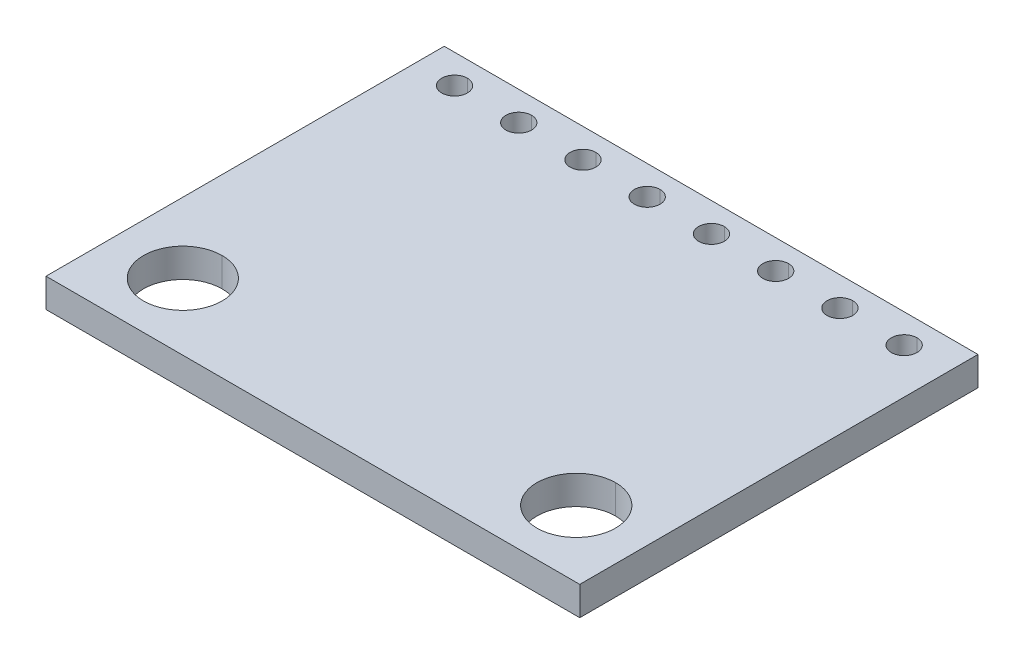
ISO-10303-21;
HEADER;
FILE_DESCRIPTION(('STEP AP214'),'2;1');
FILE_NAME('part.step','',(''),(''),'','','');
FILE_SCHEMA(('AUTOMOTIVE_DESIGN { 1 0 10303 214 1 1 1 1 }'));
ENDSEC;
DATA;
#1=APPLICATION_CONTEXT('core data for automotive mechanical design processes');
#2=APPLICATION_PROTOCOL_DEFINITION('international standard','automotive_design',2000,#1);
#3=PRODUCT_CONTEXT('',#1,'mechanical');
#4=PRODUCT('Part','Part','',(#3));
#5=PRODUCT_RELATED_PRODUCT_CATEGORY('part','',(#4));
#6=PRODUCT_DEFINITION_FORMATION('','',#4);
#7=PRODUCT_DEFINITION_CONTEXT('part definition',#1,'design');
#8=PRODUCT_DEFINITION('design','',#6,#7);
#9=PRODUCT_DEFINITION_SHAPE('','',#8);
#10=(LENGTH_UNIT() NAMED_UNIT(*) SI_UNIT(.MILLI.,.METRE.));
#11=(NAMED_UNIT(*) PLANE_ANGLE_UNIT() SI_UNIT($,.RADIAN.));
#12=(NAMED_UNIT(*) SI_UNIT($,.STERADIAN.) SOLID_ANGLE_UNIT());
#13=UNCERTAINTY_MEASURE_WITH_UNIT(LENGTH_MEASURE(1.E-05),#10,'distance_accuracy_value','');
#14=(GEOMETRIC_REPRESENTATION_CONTEXT(3) GLOBAL_UNCERTAINTY_ASSIGNED_CONTEXT((#13)) GLOBAL_UNIT_ASSIGNED_CONTEXT((#10,
#11,#12)) REPRESENTATION_CONTEXT('',''));
#15=CARTESIAN_POINT('',(0.,0.,0.));
#16=DIRECTION('',(0.,0.,1.));
#17=DIRECTION('',(1.,0.,0.));
#18=AXIS2_PLACEMENT_3D('',#15,#16,#17);
#19=CARTESIAN_POINT('',(8.7757,0.5715,-6.731));
#20=DIRECTION('',(0.,-1.,0.));
#21=DIRECTION('',(0.,0.,-1.));
#22=AXIS2_PLACEMENT_3D('',#19,#20,#21);
#23=CYLINDRICAL_SURFACE('',#22,0.508);
#24=DIRECTION('',(0.,-1.,0.));
#25=VECTOR('',#24,1.);
#26=CARTESIAN_POINT('',(8.7757,0.5715,-6.223));
#27=LINE('',#26,#25);
#28=CARTESIAN_POINT('',(8.7757,0.5715,-6.223));
#29=VERTEX_POINT('',#28);
#30=CARTESIAN_POINT('',(8.7757,-0.5715,-6.223));
#31=VERTEX_POINT('',#30);
#32=EDGE_CURVE('E352',#29,#31,#27,.T.);
#33=ORIENTED_EDGE('',*,*,#32,.F.);
#34=CARTESIAN_POINT('',(8.7757,0.5715,-6.731));
#35=DIRECTION('',(0.,1.,0.));
#36=DIRECTION('',(0.,0.,1.));
#37=AXIS2_PLACEMENT_3D('',#34,#35,#36);
#38=CIRCLE('',#37,0.508);
#39=CARTESIAN_POINT('',(8.7757,0.5715,-7.239));
#40=VERTEX_POINT('',#39);
#41=EDGE_CURVE('E236',#29,#40,#38,.T.);
#42=ORIENTED_EDGE('',*,*,#41,.T.);
#43=DIRECTION('',(0.,-1.,0.));
#44=VECTOR('',#43,1.);
#45=CARTESIAN_POINT('',(8.7757,0.5715,-7.239));
#46=LINE('',#45,#44);
#47=CARTESIAN_POINT('',(8.7757,-0.5715,-7.239));
#48=VERTEX_POINT('',#47);
#49=EDGE_CURVE('E448',#40,#48,#46,.T.);
#50=ORIENTED_EDGE('',*,*,#49,.T.);
#51=CARTESIAN_POINT('',(8.7757,-0.5715,-6.731));
#52=DIRECTION('',(0.,1.,0.));
#53=DIRECTION('',(0.,0.,1.));
#54=AXIS2_PLACEMENT_3D('',#51,#52,#53);
#55=CIRCLE('',#54,0.508);
#56=EDGE_CURVE('E318',#31,#48,#55,.T.);
#57=ORIENTED_EDGE('',*,*,#56,.F.);
#58=EDGE_LOOP('',(#33,#42,#50,#57));
#59=FACE_BOUND('',#58,.T.);
#60=ADVANCED_FACE('F18',(#59),#23,.F.);
#61=CARTESIAN_POINT('',(6.2357,0.5715,-6.731));
#62=DIRECTION('',(0.,-1.,0.));
#63=DIRECTION('',(0.,0.,-1.));
#64=AXIS2_PLACEMENT_3D('',#61,#62,#63);
#65=CYLINDRICAL_SURFACE('',#64,0.508);
#66=DIRECTION('',(0.,-1.,0.));
#67=VECTOR('',#66,1.);
#68=CARTESIAN_POINT('',(6.2357,0.5715,-6.223));
#69=LINE('',#68,#67);
#70=CARTESIAN_POINT('',(6.2357,0.5715,-6.223));
#71=VERTEX_POINT('',#70);
#72=CARTESIAN_POINT('',(6.2357,-0.5715,-6.223));
#73=VERTEX_POINT('',#72);
#74=EDGE_CURVE('E363',#71,#73,#69,.T.);
#75=ORIENTED_EDGE('',*,*,#74,.F.);
#76=CARTESIAN_POINT('',(6.2357,0.5715,-6.731));
#77=DIRECTION('',(0.,1.,0.));
#78=DIRECTION('',(0.,0.,1.));
#79=AXIS2_PLACEMENT_3D('',#76,#77,#78);
#80=CIRCLE('',#79,0.508);
#81=CARTESIAN_POINT('',(6.2357,0.5715,-7.239));
#82=VERTEX_POINT('',#81);
#83=EDGE_CURVE('E276',#71,#82,#80,.T.);
#84=ORIENTED_EDGE('',*,*,#83,.T.);
#85=DIRECTION('',(0.,-1.,0.));
#86=VECTOR('',#85,1.);
#87=CARTESIAN_POINT('',(6.2357,0.5715,-7.239));
#88=LINE('',#87,#86);
#89=CARTESIAN_POINT('',(6.2357,-0.5715,-7.239));
#90=VERTEX_POINT('',#89);
#91=EDGE_CURVE('E250',#82,#90,#88,.T.);
#92=ORIENTED_EDGE('',*,*,#91,.T.);
#93=CARTESIAN_POINT('',(6.2357,-0.5715,-6.731));
#94=DIRECTION('',(0.,1.,0.));
#95=DIRECTION('',(0.,0.,1.));
#96=AXIS2_PLACEMENT_3D('',#93,#94,#95);
#97=CIRCLE('',#96,0.508);
#98=EDGE_CURVE('E325',#73,#90,#97,.T.);
#99=ORIENTED_EDGE('',*,*,#98,.F.);
#100=EDGE_LOOP('',(#75,#84,#92,#99));
#101=FACE_BOUND('',#100,.T.);
#102=ADVANCED_FACE('F605',(#101),#65,.F.);
#103=CARTESIAN_POINT('',(3.6957,0.5715,-6.731));
#104=DIRECTION('',(0.,-1.,0.));
#105=DIRECTION('',(0.,0.,-1.));
#106=AXIS2_PLACEMENT_3D('',#103,#104,#105);
#107=CYLINDRICAL_SURFACE('',#106,0.508);
#108=DIRECTION('',(0.,-1.,0.));
#109=VECTOR('',#108,1.);
#110=CARTESIAN_POINT('',(3.6957,0.5715,-6.223));
#111=LINE('',#110,#109);
#112=CARTESIAN_POINT('',(3.6957,0.5715,-6.223));
#113=VERTEX_POINT('',#112);
#114=CARTESIAN_POINT('',(3.6957,-0.5715,-6.223));
#115=VERTEX_POINT('',#114);
#116=EDGE_CURVE('E233',#113,#115,#111,.T.);
#117=ORIENTED_EDGE('',*,*,#116,.F.);
#118=CARTESIAN_POINT('',(3.6957,0.5715,-6.731));
#119=DIRECTION('',(0.,1.,0.));
#120=DIRECTION('',(0.,0.,1.));
#121=AXIS2_PLACEMENT_3D('',#118,#119,#120);
#122=CIRCLE('',#121,0.508);
#123=CARTESIAN_POINT('',(3.6957,0.5715,-7.239));
#124=VERTEX_POINT('',#123);
#125=EDGE_CURVE('E222',#113,#124,#122,.T.);
#126=ORIENTED_EDGE('',*,*,#125,.T.);
#127=DIRECTION('',(0.,-1.,0.));
#128=VECTOR('',#127,1.);
#129=CARTESIAN_POINT('',(3.6957,0.5715,-7.239));
#130=LINE('',#129,#128);
#131=CARTESIAN_POINT('',(3.6957,-0.5715,-7.239));
#132=VERTEX_POINT('',#131);
#133=EDGE_CURVE('E230',#124,#132,#130,.T.);
#134=ORIENTED_EDGE('',*,*,#133,.T.);
#135=CARTESIAN_POINT('',(3.6957,-0.5715,-6.731));
#136=DIRECTION('',(0.,1.,0.));
#137=DIRECTION('',(0.,0.,1.));
#138=AXIS2_PLACEMENT_3D('',#135,#136,#137);
#139=CIRCLE('',#138,0.508);
#140=EDGE_CURVE('E321',#115,#132,#139,.T.);
#141=ORIENTED_EDGE('',*,*,#140,.F.);
#142=EDGE_LOOP('',(#117,#126,#134,#141));
#143=FACE_BOUND('',#142,.T.);
#144=ADVANCED_FACE('F229',(#143),#107,.F.);
#145=CARTESIAN_POINT('',(1.1557,0.5715,-6.731));
#146=DIRECTION('',(0.,-1.,0.));
#147=DIRECTION('',(0.,0.,-1.));
#148=AXIS2_PLACEMENT_3D('',#145,#146,#147);
#149=CYLINDRICAL_SURFACE('',#148,0.508);
#150=DIRECTION('',(0.,-1.,0.));
#151=VECTOR('',#150,1.);
#152=CARTESIAN_POINT('',(1.1557,0.5715,-6.223));
#153=LINE('',#152,#151);
#154=CARTESIAN_POINT('',(1.1557,0.5715,-6.223));
#155=VERTEX_POINT('',#154);
#156=CARTESIAN_POINT('',(1.1557,-0.5715,-6.223));
#157=VERTEX_POINT('',#156);
#158=EDGE_CURVE('E308',#155,#157,#153,.T.);
#159=ORIENTED_EDGE('',*,*,#158,.F.);
#160=CARTESIAN_POINT('',(1.1557,0.5715,-6.731));
#161=DIRECTION('',(0.,1.,0.));
#162=DIRECTION('',(0.,0.,1.));
#163=AXIS2_PLACEMENT_3D('',#160,#161,#162);
#164=CIRCLE('',#163,0.508);
#165=CARTESIAN_POINT('',(1.1557,0.5715,-7.239));
#166=VERTEX_POINT('',#165);
#167=EDGE_CURVE('E279',#155,#166,#164,.T.);
#168=ORIENTED_EDGE('',*,*,#167,.T.);
#169=DIRECTION('',(0.,-1.,0.));
#170=VECTOR('',#169,1.);
#171=CARTESIAN_POINT('',(1.1557,0.5715,-7.239));
#172=LINE('',#171,#170);
#173=CARTESIAN_POINT('',(1.1557,-0.5715,-7.239));
#174=VERTEX_POINT('',#173);
#175=EDGE_CURVE('E452',#166,#174,#172,.T.);
#176=ORIENTED_EDGE('',*,*,#175,.T.);
#177=CARTESIAN_POINT('',(1.1557,-0.5715,-6.731));
#178=DIRECTION('',(0.,1.,0.));
#179=DIRECTION('',(0.,0.,1.));
#180=AXIS2_PLACEMENT_3D('',#177,#178,#179);
#181=CIRCLE('',#180,0.508);
#182=EDGE_CURVE('E322',#157,#174,#181,.T.);
#183=ORIENTED_EDGE('',*,*,#182,.F.);
#184=EDGE_LOOP('',(#159,#168,#176,#183));
#185=FACE_BOUND('',#184,.T.);
#186=ADVANCED_FACE('F494',(#185),#149,.F.);
#187=CARTESIAN_POINT('',(-1.3843,0.5715,-6.731));
#188=DIRECTION('',(0.,-1.,0.));
#189=DIRECTION('',(0.,0.,-1.));
#190=AXIS2_PLACEMENT_3D('',#187,#188,#189);
#191=CYLINDRICAL_SURFACE('',#190,0.508);
#192=DIRECTION('',(0.,-1.,0.));
#193=VECTOR('',#192,1.);
#194=CARTESIAN_POINT('',(-1.3843,0.5715,-6.223));
#195=LINE('',#194,#193);
#196=CARTESIAN_POINT('',(-1.3843,0.5715,-6.223));
#197=VERTEX_POINT('',#196);
#198=CARTESIAN_POINT('',(-1.3843,-0.5715,-6.223));
#199=VERTEX_POINT('',#198);
#200=EDGE_CURVE('E373',#197,#199,#195,.T.);
#201=ORIENTED_EDGE('',*,*,#200,.F.);
#202=CARTESIAN_POINT('',(-1.3843,0.5715,-6.731));
#203=DIRECTION('',(0.,1.,0.));
#204=DIRECTION('',(0.,0.,1.));
#205=AXIS2_PLACEMENT_3D('',#202,#203,#204);
#206=CIRCLE('',#205,0.508);
#207=CARTESIAN_POINT('',(-1.3843,0.5715,-7.239));
#208=VERTEX_POINT('',#207);
#209=EDGE_CURVE('E237',#197,#208,#206,.T.);
#210=ORIENTED_EDGE('',*,*,#209,.T.);
#211=DIRECTION('',(0.,-1.,0.));
#212=VECTOR('',#211,1.);
#213=CARTESIAN_POINT('',(-1.3843,0.5715,-7.239));
#214=LINE('',#213,#212);
#215=CARTESIAN_POINT('',(-1.3843,-0.5715,-7.239));
#216=VERTEX_POINT('',#215);
#217=EDGE_CURVE('E304',#208,#216,#214,.T.);
#218=ORIENTED_EDGE('',*,*,#217,.T.);
#219=CARTESIAN_POINT('',(-1.3843,-0.5715,-6.731));
#220=DIRECTION('',(0.,1.,0.));
#221=DIRECTION('',(0.,0.,1.));
#222=AXIS2_PLACEMENT_3D('',#219,#220,#221);
#223=CIRCLE('',#222,0.508);
#224=EDGE_CURVE('E397',#199,#216,#223,.T.);
#225=ORIENTED_EDGE('',*,*,#224,.F.);
#226=EDGE_LOOP('',(#201,#210,#218,#225));
#227=FACE_BOUND('',#226,.T.);
#228=ADVANCED_FACE('F593',(#227),#191,.F.);
#229=CARTESIAN_POINT('',(-3.9243,0.5715,-6.731));
#230=DIRECTION('',(0.,-1.,0.));
#231=DIRECTION('',(0.,0.,-1.));
#232=AXIS2_PLACEMENT_3D('',#229,#230,#231);
#233=CYLINDRICAL_SURFACE('',#232,0.508);
#234=DIRECTION('',(0.,-1.,0.));
#235=VECTOR('',#234,1.);
#236=CARTESIAN_POINT('',(-3.9243,0.5715,-6.223));
#237=LINE('',#236,#235);
#238=CARTESIAN_POINT('',(-3.9243,0.5715,-6.223));
#239=VERTEX_POINT('',#238);
#240=CARTESIAN_POINT('',(-3.9243,-0.5715,-6.223));
#241=VERTEX_POINT('',#240);
#242=EDGE_CURVE('E295',#239,#241,#237,.T.);
#243=ORIENTED_EDGE('',*,*,#242,.F.);
#244=CARTESIAN_POINT('',(-3.9243,0.5715,-6.731));
#245=DIRECTION('',(0.,1.,0.));
#246=DIRECTION('',(0.,0.,1.));
#247=AXIS2_PLACEMENT_3D('',#244,#245,#246);
#248=CIRCLE('',#247,0.508);
#249=CARTESIAN_POINT('',(-3.9243,0.5715,-7.239));
#250=VERTEX_POINT('',#249);
#251=EDGE_CURVE('E413',#239,#250,#248,.T.);
#252=ORIENTED_EDGE('',*,*,#251,.T.);
#253=DIRECTION('',(0.,-1.,0.));
#254=VECTOR('',#253,1.);
#255=CARTESIAN_POINT('',(-3.9243,0.5715,-7.239));
#256=LINE('',#255,#254);
#257=CARTESIAN_POINT('',(-3.9243,-0.5715,-7.239));
#258=VERTEX_POINT('',#257);
#259=EDGE_CURVE('E412',#250,#258,#256,.T.);
#260=ORIENTED_EDGE('',*,*,#259,.T.);
#261=CARTESIAN_POINT('',(-3.9243,-0.5715,-6.731));
#262=DIRECTION('',(0.,1.,0.));
#263=DIRECTION('',(0.,0.,1.));
#264=AXIS2_PLACEMENT_3D('',#261,#262,#263);
#265=CIRCLE('',#264,0.508);
#266=EDGE_CURVE('E324',#241,#258,#265,.T.);
#267=ORIENTED_EDGE('',*,*,#266,.F.);
#268=EDGE_LOOP('',(#243,#252,#260,#267));
#269=FACE_BOUND('',#268,.T.);
#270=ADVANCED_FACE('F590',(#269),#233,.F.);
#271=CARTESIAN_POINT('',(-6.4643,0.5715,-6.731));
#272=DIRECTION('',(0.,-1.,0.));
#273=DIRECTION('',(0.,0.,-1.));
#274=AXIS2_PLACEMENT_3D('',#271,#272,#273);
#275=CYLINDRICAL_SURFACE('',#274,0.508);
#276=DIRECTION('',(0.,-1.,0.));
#277=VECTOR('',#276,1.);
#278=CARTESIAN_POINT('',(-6.4643,0.5715,-6.223));
#279=LINE('',#278,#277);
#280=CARTESIAN_POINT('',(-6.4643,0.5715,-6.223));
#281=VERTEX_POINT('',#280);
#282=CARTESIAN_POINT('',(-6.4643,-0.5715,-6.223));
#283=VERTEX_POINT('',#282);
#284=EDGE_CURVE('E402',#281,#283,#279,.T.);
#285=ORIENTED_EDGE('',*,*,#284,.F.);
#286=CARTESIAN_POINT('',(-6.4643,0.5715,-6.731));
#287=DIRECTION('',(0.,1.,0.));
#288=DIRECTION('',(0.,0.,1.));
#289=AXIS2_PLACEMENT_3D('',#286,#287,#288);
#290=CIRCLE('',#289,0.508);
#291=CARTESIAN_POINT('',(-6.4643,0.5715,-7.239));
#292=VERTEX_POINT('',#291);
#293=EDGE_CURVE('E381',#281,#292,#290,.T.);
#294=ORIENTED_EDGE('',*,*,#293,.T.);
#295=DIRECTION('',(0.,-1.,0.));
#296=VECTOR('',#295,1.);
#297=CARTESIAN_POINT('',(-6.4643,0.5715,-7.239));
#298=LINE('',#297,#296);
#299=CARTESIAN_POINT('',(-6.4643,-0.5715,-7.239));
#300=VERTEX_POINT('',#299);
#301=EDGE_CURVE('E390',#292,#300,#298,.T.);
#302=ORIENTED_EDGE('',*,*,#301,.T.);
#303=CARTESIAN_POINT('',(-6.4643,-0.5715,-6.731));
#304=DIRECTION('',(0.,1.,0.));
#305=DIRECTION('',(0.,0.,1.));
#306=AXIS2_PLACEMENT_3D('',#303,#304,#305);
#307=CIRCLE('',#306,0.508);
#308=EDGE_CURVE('E394',#283,#300,#307,.T.);
#309=ORIENTED_EDGE('',*,*,#308,.F.);
#310=EDGE_LOOP('',(#285,#294,#302,#309));
#311=FACE_BOUND('',#310,.T.);
#312=ADVANCED_FACE('F592',(#311),#275,.F.);
#313=CARTESIAN_POINT('',(-9.0043,0.5715,-6.731));
#314=DIRECTION('',(0.,-1.,0.));
#315=DIRECTION('',(0.,0.,-1.));
#316=AXIS2_PLACEMENT_3D('',#313,#314,#315);
#317=CYLINDRICAL_SURFACE('',#316,0.508);
#318=DIRECTION('',(0.,-1.,0.));
#319=VECTOR('',#318,1.);
#320=CARTESIAN_POINT('',(-9.0043,0.5715,-6.223));
#321=LINE('',#320,#319);
#322=CARTESIAN_POINT('',(-9.0043,0.5715,-6.223));
#323=VERTEX_POINT('',#322);
#324=CARTESIAN_POINT('',(-9.0043,-0.5715,-6.223));
#325=VERTEX_POINT('',#324);
#326=EDGE_CURVE('E389',#323,#325,#321,.T.);
#327=ORIENTED_EDGE('',*,*,#326,.F.);
#328=CARTESIAN_POINT('',(-9.0043,0.5715,-6.731));
#329=DIRECTION('',(0.,1.,0.));
#330=DIRECTION('',(0.,0.,1.));
#331=AXIS2_PLACEMENT_3D('',#328,#329,#330);
#332=CIRCLE('',#331,0.508);
#333=CARTESIAN_POINT('',(-9.0043,0.5715,-7.239));
#334=VERTEX_POINT('',#333);
#335=EDGE_CURVE('E416',#323,#334,#332,.T.);
#336=ORIENTED_EDGE('',*,*,#335,.T.);
#337=DIRECTION('',(0.,-1.,0.));
#338=VECTOR('',#337,1.);
#339=CARTESIAN_POINT('',(-9.0043,0.5715,-7.239));
#340=LINE('',#339,#338);
#341=CARTESIAN_POINT('',(-9.0043,-0.5715,-7.239));
#342=VERTEX_POINT('',#341);
#343=EDGE_CURVE('E265',#334,#342,#340,.T.);
#344=ORIENTED_EDGE('',*,*,#343,.T.);
#345=CARTESIAN_POINT('',(-9.0043,-0.5715,-6.731));
#346=DIRECTION('',(0.,1.,0.));
#347=DIRECTION('',(0.,0.,1.));
#348=AXIS2_PLACEMENT_3D('',#345,#346,#347);
#349=CIRCLE('',#348,0.508);
#350=EDGE_CURVE('E119',#325,#342,#349,.T.);
#351=ORIENTED_EDGE('',*,*,#350,.F.);
#352=EDGE_LOOP('',(#327,#336,#344,#351));
#353=FACE_BOUND('',#352,.T.);
#354=ADVANCED_FACE('F578',(#353),#317,.F.);
#355=CARTESIAN_POINT('',(7.77875,0.5715,5.23875));
#356=DIRECTION('',(0.,-1.,0.));
#357=DIRECTION('',(0.,0.,-1.));
#358=AXIS2_PLACEMENT_3D('',#355,#356,#357);
#359=CYLINDRICAL_SURFACE('',#358,1.55575);
#360=DIRECTION('',(0.,-1.,0.));
#361=VECTOR('',#360,1.);
#362=CARTESIAN_POINT('',(7.77875,0.5715,6.7945));
#363=LINE('',#362,#361);
#364=CARTESIAN_POINT('',(7.77875,0.5715,6.7945));
#365=VERTEX_POINT('',#364);
#366=CARTESIAN_POINT('',(7.77875,-0.5715,6.7945));
#367=VERTEX_POINT('',#366);
#368=EDGE_CURVE('E286',#365,#367,#363,.T.);
#369=ORIENTED_EDGE('',*,*,#368,.F.);
#370=CARTESIAN_POINT('',(7.77875,0.5715,5.23875));
#371=DIRECTION('',(0.,1.,0.));
#372=DIRECTION('',(0.,0.,-1.));
#373=AXIS2_PLACEMENT_3D('',#370,#371,#372);
#374=CIRCLE('',#373,1.55575);
#375=CARTESIAN_POINT('',(7.77875,0.5715,3.683));
#376=VERTEX_POINT('',#375);
#377=EDGE_CURVE('E133',#365,#376,#374,.T.);
#378=ORIENTED_EDGE('',*,*,#377,.T.);
#379=DIRECTION('',(0.,-1.,0.));
#380=VECTOR('',#379,1.);
#381=CARTESIAN_POINT('',(7.77875,0.5715,3.683));
#382=LINE('',#381,#380);
#383=CARTESIAN_POINT('',(7.77875,-0.5715,3.683));
#384=VERTEX_POINT('',#383);
#385=EDGE_CURVE('E285',#376,#384,#382,.T.);
#386=ORIENTED_EDGE('',*,*,#385,.T.);
#387=CARTESIAN_POINT('',(7.77875,-0.5715,5.23875));
#388=DIRECTION('',(0.,1.,0.));
#389=DIRECTION('',(0.,0.,-1.));
#390=AXIS2_PLACEMENT_3D('',#387,#388,#389);
#391=CIRCLE('',#390,1.55575);
#392=EDGE_CURVE('E393',#367,#384,#391,.T.);
#393=ORIENTED_EDGE('',*,*,#392,.F.);
#394=EDGE_LOOP('',(#369,#378,#386,#393));
#395=FACE_BOUND('',#394,.T.);
#396=ADVANCED_FACE('F20',(#395),#359,.F.);
#397=CARTESIAN_POINT('',(-7.77875,0.5715,5.23875));
#398=DIRECTION('',(0.,-1.,0.));
#399=DIRECTION('',(0.,0.,-1.));
#400=AXIS2_PLACEMENT_3D('',#397,#398,#399);
#401=CYLINDRICAL_SURFACE('',#400,1.55575);
#402=DIRECTION('',(0.,-1.,0.));
#403=VECTOR('',#402,1.);
#404=CARTESIAN_POINT('',(-7.77875,0.5715,6.7945));
#405=LINE('',#404,#403);
#406=CARTESIAN_POINT('',(-7.77875,0.5715,6.7945));
#407=VERTEX_POINT('',#406);
#408=CARTESIAN_POINT('',(-7.77875,-0.5715,6.7945));
#409=VERTEX_POINT('',#408);
#410=EDGE_CURVE('E270',#407,#409,#405,.T.);
#411=ORIENTED_EDGE('',*,*,#410,.F.);
#412=CARTESIAN_POINT('',(-7.77875,0.5715,5.23875));
#413=DIRECTION('',(0.,1.,0.));
#414=DIRECTION('',(0.,0.,1.));
#415=AXIS2_PLACEMENT_3D('',#412,#413,#414);
#416=CIRCLE('',#415,1.55575);
#417=CARTESIAN_POINT('',(-7.77875,0.5715,3.683));
#418=VERTEX_POINT('',#417);
#419=EDGE_CURVE('E22',#407,#418,#416,.T.);
#420=ORIENTED_EDGE('',*,*,#419,.T.);
#421=DIRECTION('',(0.,-1.,0.));
#422=VECTOR('',#421,1.);
#423=CARTESIAN_POINT('',(-7.77875,0.5715,3.683));
#424=LINE('',#423,#422);
#425=CARTESIAN_POINT('',(-7.77875,-0.5715,3.683));
#426=VERTEX_POINT('',#425);
#427=EDGE_CURVE('E291',#418,#426,#424,.T.);
#428=ORIENTED_EDGE('',*,*,#427,.T.);
#429=CARTESIAN_POINT('',(-7.77875,-0.5715,5.23875));
#430=DIRECTION('',(0.,1.,0.));
#431=DIRECTION('',(0.,0.,1.));
#432=AXIS2_PLACEMENT_3D('',#429,#430,#431);
#433=CIRCLE('',#432,1.55575);
#434=EDGE_CURVE('E175',#409,#426,#433,.T.);
#435=ORIENTED_EDGE('',*,*,#434,.F.);
#436=EDGE_LOOP('',(#411,#420,#428,#435));
#437=FACE_BOUND('',#436,.T.);
#438=ADVANCED_FACE('F639',(#437),#401,.F.);
#439=CARTESIAN_POINT('',(-10.5537,0.5715,7.874));
#440=DIRECTION('',(0.,0.,-1.));
#441=DIRECTION('',(0.,-1.,0.));
#442=AXIS2_PLACEMENT_3D('',#439,#440,#441);
#443=PLANE('',#442);
#444=DIRECTION('',(1.,0.,0.));
#445=VECTOR('',#444,1.);
#446=CARTESIAN_POINT('',(-10.5537,-0.5715,7.874));
#447=LINE('',#446,#445);
#448=CARTESIAN_POINT('',(-10.5537,-0.5715,7.874));
#449=VERTEX_POINT('',#448);
#450=CARTESIAN_POINT('',(10.5537,-0.5715,7.874));
#451=VERTEX_POINT('',#450);
#452=EDGE_CURVE('E263',#449,#451,#447,.T.);
#453=ORIENTED_EDGE('',*,*,#452,.T.);
#454=DIRECTION('',(0.,-1.,0.));
#455=VECTOR('',#454,1.);
#456=CARTESIAN_POINT('',(10.5537,0.5715,7.874));
#457=LINE('',#456,#455);
#458=CARTESIAN_POINT('',(10.5537,0.5715,7.874));
#459=VERTEX_POINT('',#458);
#460=EDGE_CURVE('E445',#459,#451,#457,.T.);
#461=ORIENTED_EDGE('',*,*,#460,.F.);
#462=DIRECTION('',(1.,0.,0.));
#463=VECTOR('',#462,1.);
#464=CARTESIAN_POINT('',(-10.5537,0.5715,7.874));
#465=LINE('',#464,#463);
#466=CARTESIAN_POINT('',(-10.5537,0.5715,7.874));
#467=VERTEX_POINT('',#466);
#468=EDGE_CURVE('E280',#467,#459,#465,.T.);
#469=ORIENTED_EDGE('',*,*,#468,.F.);
#470=DIRECTION('',(0.,-1.,0.));
#471=VECTOR('',#470,1.);
#472=CARTESIAN_POINT('',(-10.5537,0.5715,7.874));
#473=LINE('',#472,#471);
#474=EDGE_CURVE('E11',#467,#449,#473,.T.);
#475=ORIENTED_EDGE('',*,*,#474,.T.);
#476=EDGE_LOOP('',(#453,#461,#469,#475));
#477=FACE_BOUND('',#476,.T.);
#478=ADVANCED_FACE('F642',(#477),#443,.F.);
#479=CARTESIAN_POINT('',(-10.5537,0.5715,7.874));
#480=DIRECTION('',(1.,0.,0.));
#481=DIRECTION('',(0.,1.,0.));
#482=AXIS2_PLACEMENT_3D('',#479,#480,#481);
#483=PLANE('',#482);
#484=DIRECTION('',(0.,0.,1.));
#485=VECTOR('',#484,1.);
#486=CARTESIAN_POINT('',(-10.5537,-0.5715,7.874));
#487=LINE('',#486,#485);
#488=CARTESIAN_POINT('',(-10.5537,-0.5715,-7.874));
#489=VERTEX_POINT('',#488);
#490=EDGE_CURVE('E343',#489,#449,#487,.T.);
#491=ORIENTED_EDGE('',*,*,#490,.T.);
#492=ORIENTED_EDGE('',*,*,#474,.F.);
#493=DIRECTION('',(0.,0.,1.));
#494=VECTOR('',#493,1.);
#495=CARTESIAN_POINT('',(-10.5537,0.5715,7.874));
#496=LINE('',#495,#494);
#497=CARTESIAN_POINT('',(-10.5537,0.5715,-7.874));
#498=VERTEX_POINT('',#497);
#499=EDGE_CURVE('E313',#498,#467,#496,.T.);
#500=ORIENTED_EDGE('',*,*,#499,.F.);
#501=DIRECTION('',(0.,-1.,0.));
#502=VECTOR('',#501,1.);
#503=CARTESIAN_POINT('',(-10.5537,0.5715,-7.874));
#504=LINE('',#503,#502);
#505=EDGE_CURVE('E29',#498,#489,#504,.T.);
#506=ORIENTED_EDGE('',*,*,#505,.T.);
#507=EDGE_LOOP('',(#491,#492,#500,#506));
#508=FACE_BOUND('',#507,.T.);
#509=ADVANCED_FACE('F524',(#508),#483,.F.);
#510=CARTESIAN_POINT('',(-10.5537,0.5715,-7.874));
#511=DIRECTION('',(0.,0.,1.));
#512=DIRECTION('',(1.,0.,0.));
#513=AXIS2_PLACEMENT_3D('',#510,#511,#512);
#514=PLANE('',#513);
#515=DIRECTION('',(-1.,0.,0.));
#516=VECTOR('',#515,1.);
#517=CARTESIAN_POINT('',(-10.5537,-0.5715,-7.874));
#518=LINE('',#517,#516);
#519=CARTESIAN_POINT('',(10.5537,-0.5715,-7.874));
#520=VERTEX_POINT('',#519);
#521=EDGE_CURVE('E335',#520,#489,#518,.T.);
#522=ORIENTED_EDGE('',*,*,#521,.T.);
#523=ORIENTED_EDGE('',*,*,#505,.F.);
#524=DIRECTION('',(-1.,0.,0.));
#525=VECTOR('',#524,1.);
#526=CARTESIAN_POINT('',(-10.5537,0.5715,-7.874));
#527=LINE('',#526,#525);
#528=CARTESIAN_POINT('',(10.5537,0.5715,-7.874));
#529=VERTEX_POINT('',#528);
#530=EDGE_CURVE('E317',#529,#498,#527,.T.);
#531=ORIENTED_EDGE('',*,*,#530,.F.);
#532=DIRECTION('',(0.,-1.,0.));
#533=VECTOR('',#532,1.);
#534=CARTESIAN_POINT('',(10.5537,0.5715,-7.874));
#535=LINE('',#534,#533);
#536=EDGE_CURVE('E320',#529,#520,#535,.T.);
#537=ORIENTED_EDGE('',*,*,#536,.T.);
#538=EDGE_LOOP('',(#522,#523,#531,#537));
#539=FACE_BOUND('',#538,.T.);
#540=ADVANCED_FACE('F518',(#539),#514,.F.);
#541=CARTESIAN_POINT('',(10.5537,0.5715,7.874));
#542=DIRECTION('',(-1.,0.,0.));
#543=DIRECTION('',(0.,0.,1.));
#544=AXIS2_PLACEMENT_3D('',#541,#542,#543);
#545=PLANE('',#544);
#546=DIRECTION('',(0.,0.,-1.));
#547=VECTOR('',#546,1.);
#548=CARTESIAN_POINT('',(10.5537,-0.5715,7.874));
#549=LINE('',#548,#547);
#550=EDGE_CURVE('E287',#451,#520,#549,.T.);
#551=ORIENTED_EDGE('',*,*,#550,.T.);
#552=ORIENTED_EDGE('',*,*,#536,.F.);
#553=DIRECTION('',(0.,0.,-1.));
#554=VECTOR('',#553,1.);
#555=CARTESIAN_POINT('',(10.5537,0.5715,7.874));
#556=LINE('',#555,#554);
#557=EDGE_CURVE('E294',#459,#529,#556,.T.);
#558=ORIENTED_EDGE('',*,*,#557,.F.);
#559=ORIENTED_EDGE('',*,*,#460,.T.);
#560=EDGE_LOOP('',(#551,#552,#558,#559));
#561=FACE_BOUND('',#560,.T.);
#562=ADVANCED_FACE('F512',(#561),#545,.F.);
#563=CARTESIAN_POINT('',(0.,-0.5715,0.));
#564=DIRECTION('',(0.,-1.,0.));
#565=DIRECTION('',(0.,0.,-1.));
#566=AXIS2_PLACEMENT_3D('',#563,#564,#565);
#567=PLANE('',#566);
#568=CARTESIAN_POINT('',(8.7757,-0.5715,-6.731));
#569=DIRECTION('',(0.,1.,0.));
#570=DIRECTION('',(0.,0.,1.));
#571=AXIS2_PLACEMENT_3D('',#568,#569,#570);
#572=CIRCLE('',#571,0.508);
#573=EDGE_CURVE('E362',#48,#31,#572,.T.);
#574=ORIENTED_EDGE('',*,*,#573,.T.);
#575=ORIENTED_EDGE('',*,*,#56,.T.);
#576=EDGE_LOOP('',(#574,#575));
#577=FACE_BOUND('',#576,.T.);
#578=CARTESIAN_POINT('',(3.6957,-0.5715,-6.731));
#579=DIRECTION('',(0.,1.,0.));
#580=DIRECTION('',(0.,0.,1.));
#581=AXIS2_PLACEMENT_3D('',#578,#579,#580);
#582=CIRCLE('',#581,0.508);
#583=EDGE_CURVE('E243',#132,#115,#582,.T.);
#584=ORIENTED_EDGE('',*,*,#583,.T.);
#585=ORIENTED_EDGE('',*,*,#140,.T.);
#586=EDGE_LOOP('',(#584,#585));
#587=FACE_BOUND('',#586,.T.);
#588=CARTESIAN_POINT('',(-1.3843,-0.5715,-6.731));
#589=DIRECTION('',(0.,1.,0.));
#590=DIRECTION('',(0.,0.,1.));
#591=AXIS2_PLACEMENT_3D('',#588,#589,#590);
#592=CIRCLE('',#591,0.508);
#593=EDGE_CURVE('E377',#216,#199,#592,.T.);
#594=ORIENTED_EDGE('',*,*,#593,.T.);
#595=ORIENTED_EDGE('',*,*,#224,.T.);
#596=EDGE_LOOP('',(#594,#595));
#597=FACE_BOUND('',#596,.T.);
#598=CARTESIAN_POINT('',(-6.4643,-0.5715,-6.731));
#599=DIRECTION('',(0.,1.,0.));
#600=DIRECTION('',(0.,0.,1.));
#601=AXIS2_PLACEMENT_3D('',#598,#599,#600);
#602=CIRCLE('',#601,0.508);
#603=EDGE_CURVE('E398',#300,#283,#602,.T.);
#604=ORIENTED_EDGE('',*,*,#603,.T.);
#605=ORIENTED_EDGE('',*,*,#308,.T.);
#606=EDGE_LOOP('',(#604,#605));
#607=FACE_BOUND('',#606,.T.);
#608=CARTESIAN_POINT('',(7.77875,-0.5715,5.23875));
#609=DIRECTION('',(0.,1.,0.));
#610=DIRECTION('',(0.,0.,-1.));
#611=AXIS2_PLACEMENT_3D('',#608,#609,#610);
#612=CIRCLE('',#611,1.55575);
#613=EDGE_CURVE('E281',#384,#367,#612,.T.);
#614=ORIENTED_EDGE('',*,*,#613,.T.);
#615=ORIENTED_EDGE('',*,*,#392,.T.);
#616=EDGE_LOOP('',(#614,#615));
#617=FACE_BOUND('',#616,.T.);
#618=CARTESIAN_POINT('',(-7.77875,-0.5715,5.23875));
#619=DIRECTION('',(0.,1.,0.));
#620=DIRECTION('',(0.,0.,1.));
#621=AXIS2_PLACEMENT_3D('',#618,#619,#620);
#622=CIRCLE('',#621,1.55575);
#623=EDGE_CURVE('E274',#426,#409,#622,.T.);
#624=ORIENTED_EDGE('',*,*,#623,.T.);
#625=ORIENTED_EDGE('',*,*,#434,.T.);
#626=EDGE_LOOP('',(#624,#625));
#627=FACE_BOUND('',#626,.T.);
#628=CARTESIAN_POINT('',(-9.0043,-0.5715,-6.731));
#629=DIRECTION('',(0.,1.,0.));
#630=DIRECTION('',(0.,0.,1.));
#631=AXIS2_PLACEMENT_3D('',#628,#629,#630);
#632=CIRCLE('',#631,0.508);
#633=EDGE_CURVE('E269',#342,#325,#632,.T.);
#634=ORIENTED_EDGE('',*,*,#633,.T.);
#635=ORIENTED_EDGE('',*,*,#350,.T.);
#636=EDGE_LOOP('',(#634,#635));
#637=FACE_BOUND('',#636,.T.);
#638=CARTESIAN_POINT('',(-3.9243,-0.5715,-6.731));
#639=DIRECTION('',(0.,1.,0.));
#640=DIRECTION('',(0.,0.,1.));
#641=AXIS2_PLACEMENT_3D('',#638,#639,#640);
#642=CIRCLE('',#641,0.508);
#643=EDGE_CURVE('E299',#258,#241,#642,.T.);
#644=ORIENTED_EDGE('',*,*,#643,.T.);
#645=ORIENTED_EDGE('',*,*,#266,.T.);
#646=EDGE_LOOP('',(#644,#645));
#647=FACE_BOUND('',#646,.T.);
#648=CARTESIAN_POINT('',(1.1557,-0.5715,-6.731));
#649=DIRECTION('',(0.,1.,0.));
#650=DIRECTION('',(0.,0.,1.));
#651=AXIS2_PLACEMENT_3D('',#648,#649,#650);
#652=CIRCLE('',#651,0.508);
#653=EDGE_CURVE('E312',#174,#157,#652,.T.);
#654=ORIENTED_EDGE('',*,*,#653,.T.);
#655=ORIENTED_EDGE('',*,*,#182,.T.);
#656=EDGE_LOOP('',(#654,#655));
#657=FACE_BOUND('',#656,.T.);
#658=CARTESIAN_POINT('',(6.2357,-0.5715,-6.731));
#659=DIRECTION('',(0.,1.,0.));
#660=DIRECTION('',(0.,0.,1.));
#661=AXIS2_PLACEMENT_3D('',#658,#659,#660);
#662=CIRCLE('',#661,0.508);
#663=EDGE_CURVE('E259',#90,#73,#662,.T.);
#664=ORIENTED_EDGE('',*,*,#663,.T.);
#665=ORIENTED_EDGE('',*,*,#98,.T.);
#666=EDGE_LOOP('',(#664,#665));
#667=FACE_BOUND('',#666,.T.);
#668=ORIENTED_EDGE('',*,*,#550,.F.);
#669=ORIENTED_EDGE('',*,*,#452,.F.);
#670=ORIENTED_EDGE('',*,*,#490,.F.);
#671=ORIENTED_EDGE('',*,*,#521,.F.);
#672=EDGE_LOOP('',(#668,#669,#670,#671));
#673=FACE_BOUND('',#672,.T.);
#674=ADVANCED_FACE('F503',(#577,#587,#597,#607,#617,#627,#637,#647,#657,#667,#673),#567,.T.);
#675=CARTESIAN_POINT('',(0.,0.5715,0.));
#676=DIRECTION('',(0.,-1.,0.));
#677=DIRECTION('',(0.,0.,-1.));
#678=AXIS2_PLACEMENT_3D('',#675,#676,#677);
#679=PLANE('',#678);
#680=CARTESIAN_POINT('',(8.7757,0.5715,-6.731));
#681=DIRECTION('',(0.,1.,0.));
#682=DIRECTION('',(0.,0.,1.));
#683=AXIS2_PLACEMENT_3D('',#680,#681,#682);
#684=CIRCLE('',#683,0.508);
#685=EDGE_CURVE('E348',#40,#29,#684,.T.);
#686=ORIENTED_EDGE('',*,*,#685,.F.);
#687=ORIENTED_EDGE('',*,*,#41,.F.);
#688=EDGE_LOOP('',(#686,#687));
#689=FACE_BOUND('',#688,.T.);
#690=CARTESIAN_POINT('',(3.6957,0.5715,-6.731));
#691=DIRECTION('',(0.,1.,0.));
#692=DIRECTION('',(0.,0.,1.));
#693=AXIS2_PLACEMENT_3D('',#690,#691,#692);
#694=CIRCLE('',#693,0.508);
#695=EDGE_CURVE('E241',#124,#113,#694,.T.);
#696=ORIENTED_EDGE('',*,*,#695,.F.);
#697=ORIENTED_EDGE('',*,*,#125,.F.);
#698=EDGE_LOOP('',(#696,#697));
#699=FACE_BOUND('',#698,.T.);
#700=CARTESIAN_POINT('',(-1.3843,0.5715,-6.731));
#701=DIRECTION('',(0.,1.,0.));
#702=DIRECTION('',(0.,0.,1.));
#703=AXIS2_PLACEMENT_3D('',#700,#701,#702);
#704=CIRCLE('',#703,0.508);
#705=EDGE_CURVE('E378',#208,#197,#704,.T.);
#706=ORIENTED_EDGE('',*,*,#705,.F.);
#707=ORIENTED_EDGE('',*,*,#209,.F.);
#708=EDGE_LOOP('',(#706,#707));
#709=FACE_BOUND('',#708,.T.);
#710=CARTESIAN_POINT('',(-6.4643,0.5715,-6.731));
#711=DIRECTION('',(0.,1.,0.));
#712=DIRECTION('',(0.,0.,1.));
#713=AXIS2_PLACEMENT_3D('',#710,#711,#712);
#714=CIRCLE('',#713,0.508);
#715=EDGE_CURVE('E422',#292,#281,#714,.T.);
#716=ORIENTED_EDGE('',*,*,#715,.F.);
#717=ORIENTED_EDGE('',*,*,#293,.F.);
#718=EDGE_LOOP('',(#716,#717));
#719=FACE_BOUND('',#718,.T.);
#720=CARTESIAN_POINT('',(7.77875,0.5715,5.23875));
#721=DIRECTION('',(0.,1.,0.));
#722=DIRECTION('',(0.,0.,-1.));
#723=AXIS2_PLACEMENT_3D('',#720,#721,#722);
#724=CIRCLE('',#723,1.55575);
#725=EDGE_CURVE('E268',#376,#365,#724,.T.);
#726=ORIENTED_EDGE('',*,*,#725,.F.);
#727=ORIENTED_EDGE('',*,*,#377,.F.);
#728=EDGE_LOOP('',(#726,#727));
#729=FACE_BOUND('',#728,.T.);
#730=CARTESIAN_POINT('',(-7.77875,0.5715,5.23875));
#731=DIRECTION('',(0.,1.,0.));
#732=DIRECTION('',(0.,0.,1.));
#733=AXIS2_PLACEMENT_3D('',#730,#731,#732);
#734=CIRCLE('',#733,1.55575);
#735=EDGE_CURVE('E275',#418,#407,#734,.T.);
#736=ORIENTED_EDGE('',*,*,#735,.F.);
#737=ORIENTED_EDGE('',*,*,#419,.F.);
#738=EDGE_LOOP('',(#736,#737));
#739=FACE_BOUND('',#738,.T.);
#740=CARTESIAN_POINT('',(-9.0043,0.5715,-6.731));
#741=DIRECTION('',(0.,1.,0.));
#742=DIRECTION('',(0.,0.,1.));
#743=AXIS2_PLACEMENT_3D('',#740,#741,#742);
#744=CIRCLE('',#743,0.508);
#745=EDGE_CURVE('E385',#334,#323,#744,.T.);
#746=ORIENTED_EDGE('',*,*,#745,.F.);
#747=ORIENTED_EDGE('',*,*,#335,.F.);
#748=EDGE_LOOP('',(#746,#747));
#749=FACE_BOUND('',#748,.T.);
#750=CARTESIAN_POINT('',(-3.9243,0.5715,-6.731));
#751=DIRECTION('',(0.,1.,0.));
#752=DIRECTION('',(0.,0.,1.));
#753=AXIS2_PLACEMENT_3D('',#750,#751,#752);
#754=CIRCLE('',#753,0.508);
#755=EDGE_CURVE('E300',#250,#239,#754,.T.);
#756=ORIENTED_EDGE('',*,*,#755,.F.);
#757=ORIENTED_EDGE('',*,*,#251,.F.);
#758=EDGE_LOOP('',(#756,#757));
#759=FACE_BOUND('',#758,.T.);
#760=CARTESIAN_POINT('',(1.1557,0.5715,-6.731));
#761=DIRECTION('',(0.,1.,0.));
#762=DIRECTION('',(0.,0.,1.));
#763=AXIS2_PLACEMENT_3D('',#760,#761,#762);
#764=CIRCLE('',#763,0.508);
#765=EDGE_CURVE('E245',#166,#155,#764,.T.);
#766=ORIENTED_EDGE('',*,*,#765,.F.);
#767=ORIENTED_EDGE('',*,*,#167,.F.);
#768=EDGE_LOOP('',(#766,#767));
#769=FACE_BOUND('',#768,.T.);
#770=CARTESIAN_POINT('',(6.2357,0.5715,-6.731));
#771=DIRECTION('',(0.,1.,0.));
#772=DIRECTION('',(0.,0.,1.));
#773=AXIS2_PLACEMENT_3D('',#770,#771,#772);
#774=CIRCLE('',#773,0.508);
#775=EDGE_CURVE('E367',#82,#71,#774,.T.);
#776=ORIENTED_EDGE('',*,*,#775,.F.);
#777=ORIENTED_EDGE('',*,*,#83,.F.);
#778=EDGE_LOOP('',(#776,#777));
#779=FACE_BOUND('',#778,.T.);
#780=ORIENTED_EDGE('',*,*,#557,.T.);
#781=ORIENTED_EDGE('',*,*,#530,.T.);
#782=ORIENTED_EDGE('',*,*,#499,.T.);
#783=ORIENTED_EDGE('',*,*,#468,.T.);
#784=EDGE_LOOP('',(#780,#781,#782,#783));
#785=FACE_BOUND('',#784,.T.);
#786=ADVANCED_FACE('F247',(#689,#699,#709,#719,#729,#739,#749,#759,#769,#779,#785),#679,.F.);
#787=CARTESIAN_POINT('',(-7.77875,0.5715,5.23875));
#788=DIRECTION('',(0.,-1.,0.));
#789=DIRECTION('',(0.,0.,-1.));
#790=AXIS2_PLACEMENT_3D('',#787,#788,#789);
#791=CYLINDRICAL_SURFACE('',#790,1.55575);
#792=ORIENTED_EDGE('',*,*,#735,.T.);
#793=ORIENTED_EDGE('',*,*,#410,.T.);
#794=ORIENTED_EDGE('',*,*,#623,.F.);
#795=ORIENTED_EDGE('',*,*,#427,.F.);
#796=EDGE_LOOP('',(#792,#793,#794,#795));
#797=FACE_BOUND('',#796,.T.);
#798=ADVANCED_FACE('F502',(#797),#791,.F.);
#799=CARTESIAN_POINT('',(7.77875,0.5715,5.23875));
#800=DIRECTION('',(0.,-1.,0.));
#801=DIRECTION('',(0.,0.,-1.));
#802=AXIS2_PLACEMENT_3D('',#799,#800,#801);
#803=CYLINDRICAL_SURFACE('',#802,1.55575);
#804=ORIENTED_EDGE('',*,*,#725,.T.);
#805=ORIENTED_EDGE('',*,*,#368,.T.);
#806=ORIENTED_EDGE('',*,*,#613,.F.);
#807=ORIENTED_EDGE('',*,*,#385,.F.);
#808=EDGE_LOOP('',(#804,#805,#806,#807));
#809=FACE_BOUND('',#808,.T.);
#810=ADVANCED_FACE('F619',(#809),#803,.F.);
#811=CARTESIAN_POINT('',(-9.0043,0.5715,-6.731));
#812=DIRECTION('',(0.,-1.,0.));
#813=DIRECTION('',(0.,0.,-1.));
#814=AXIS2_PLACEMENT_3D('',#811,#812,#813);
#815=CYLINDRICAL_SURFACE('',#814,0.508);
#816=ORIENTED_EDGE('',*,*,#745,.T.);
#817=ORIENTED_EDGE('',*,*,#326,.T.);
#818=ORIENTED_EDGE('',*,*,#633,.F.);
#819=ORIENTED_EDGE('',*,*,#343,.F.);
#820=EDGE_LOOP('',(#816,#817,#818,#819));
#821=FACE_BOUND('',#820,.T.);
#822=ADVANCED_FACE('F582',(#821),#815,.F.);
#823=CARTESIAN_POINT('',(-6.4643,0.5715,-6.731));
#824=DIRECTION('',(0.,-1.,0.));
#825=DIRECTION('',(0.,0.,-1.));
#826=AXIS2_PLACEMENT_3D('',#823,#824,#825);
#827=CYLINDRICAL_SURFACE('',#826,0.508);
#828=ORIENTED_EDGE('',*,*,#715,.T.);
#829=ORIENTED_EDGE('',*,*,#284,.T.);
#830=ORIENTED_EDGE('',*,*,#603,.F.);
#831=ORIENTED_EDGE('',*,*,#301,.F.);
#832=EDGE_LOOP('',(#828,#829,#830,#831));
#833=FACE_BOUND('',#832,.T.);
#834=ADVANCED_FACE('F615',(#833),#827,.F.);
#835=CARTESIAN_POINT('',(-3.9243,0.5715,-6.731));
#836=DIRECTION('',(0.,-1.,0.));
#837=DIRECTION('',(0.,0.,-1.));
#838=AXIS2_PLACEMENT_3D('',#835,#836,#837);
#839=CYLINDRICAL_SURFACE('',#838,0.508);
#840=ORIENTED_EDGE('',*,*,#755,.T.);
#841=ORIENTED_EDGE('',*,*,#242,.T.);
#842=ORIENTED_EDGE('',*,*,#643,.F.);
#843=ORIENTED_EDGE('',*,*,#259,.F.);
#844=EDGE_LOOP('',(#840,#841,#842,#843));
#845=FACE_BOUND('',#844,.T.);
#846=ADVANCED_FACE('F588',(#845),#839,.F.);
#847=CARTESIAN_POINT('',(-1.3843,0.5715,-6.731));
#848=DIRECTION('',(0.,-1.,0.));
#849=DIRECTION('',(0.,0.,-1.));
#850=AXIS2_PLACEMENT_3D('',#847,#848,#849);
#851=CYLINDRICAL_SURFACE('',#850,0.508);
#852=ORIENTED_EDGE('',*,*,#705,.T.);
#853=ORIENTED_EDGE('',*,*,#200,.T.);
#854=ORIENTED_EDGE('',*,*,#593,.F.);
#855=ORIENTED_EDGE('',*,*,#217,.F.);
#856=EDGE_LOOP('',(#852,#853,#854,#855));
#857=FACE_BOUND('',#856,.T.);
#858=ADVANCED_FACE('F631',(#857),#851,.F.);
#859=CARTESIAN_POINT('',(1.1557,0.5715,-6.731));
#860=DIRECTION('',(0.,-1.,0.));
#861=DIRECTION('',(0.,0.,-1.));
#862=AXIS2_PLACEMENT_3D('',#859,#860,#861);
#863=CYLINDRICAL_SURFACE('',#862,0.508);
#864=ORIENTED_EDGE('',*,*,#765,.T.);
#865=ORIENTED_EDGE('',*,*,#158,.T.);
#866=ORIENTED_EDGE('',*,*,#653,.F.);
#867=ORIENTED_EDGE('',*,*,#175,.F.);
#868=EDGE_LOOP('',(#864,#865,#866,#867));
#869=FACE_BOUND('',#868,.T.);
#870=ADVANCED_FACE('F499',(#869),#863,.F.);
#871=CARTESIAN_POINT('',(3.6957,0.5715,-6.731));
#872=DIRECTION('',(0.,-1.,0.));
#873=DIRECTION('',(0.,0.,-1.));
#874=AXIS2_PLACEMENT_3D('',#871,#872,#873);
#875=CYLINDRICAL_SURFACE('',#874,0.508);
#876=ORIENTED_EDGE('',*,*,#695,.T.);
#877=ORIENTED_EDGE('',*,*,#116,.T.);
#878=ORIENTED_EDGE('',*,*,#583,.F.);
#879=ORIENTED_EDGE('',*,*,#133,.F.);
#880=EDGE_LOOP('',(#876,#877,#878,#879));
#881=FACE_BOUND('',#880,.T.);
#882=ADVANCED_FACE('F240',(#881),#875,.F.);
#883=CARTESIAN_POINT('',(6.2357,0.5715,-6.731));
#884=DIRECTION('',(0.,-1.,0.));
#885=DIRECTION('',(0.,0.,-1.));
#886=AXIS2_PLACEMENT_3D('',#883,#884,#885);
#887=CYLINDRICAL_SURFACE('',#886,0.508);
#888=ORIENTED_EDGE('',*,*,#775,.T.);
#889=ORIENTED_EDGE('',*,*,#74,.T.);
#890=ORIENTED_EDGE('',*,*,#663,.F.);
#891=ORIENTED_EDGE('',*,*,#91,.F.);
#892=EDGE_LOOP('',(#888,#889,#890,#891));
#893=FACE_BOUND('',#892,.T.);
#894=ADVANCED_FACE('F623',(#893),#887,.F.);
#895=CARTESIAN_POINT('',(8.7757,0.5715,-6.731));
#896=DIRECTION('',(0.,-1.,0.));
#897=DIRECTION('',(0.,0.,-1.));
#898=AXIS2_PLACEMENT_3D('',#895,#896,#897);
#899=CYLINDRICAL_SURFACE('',#898,0.508);
#900=ORIENTED_EDGE('',*,*,#685,.T.);
#901=ORIENTED_EDGE('',*,*,#32,.T.);
#902=ORIENTED_EDGE('',*,*,#573,.F.);
#903=ORIENTED_EDGE('',*,*,#49,.F.);
#904=EDGE_LOOP('',(#900,#901,#902,#903));
#905=FACE_BOUND('',#904,.T.);
#906=ADVANCED_FACE('F546',(#905),#899,.F.);
#907=CLOSED_SHELL('',(#60,#102,#144,#186,#228,#270,#312,#354,#396,#438,#478,#509,#540,#562,#674,
#786,#798,#810,#822,#834,#846,#858,#870,#882,#894,#906));
#908=MANIFOLD_SOLID_BREP('B1',#907);
#909=ADVANCED_BREP_SHAPE_REPRESENTATION('',(#18,#908),#14);
#910=SHAPE_DEFINITION_REPRESENTATION(#9,#909);
ENDSEC;
END-ISO-10303-21;
